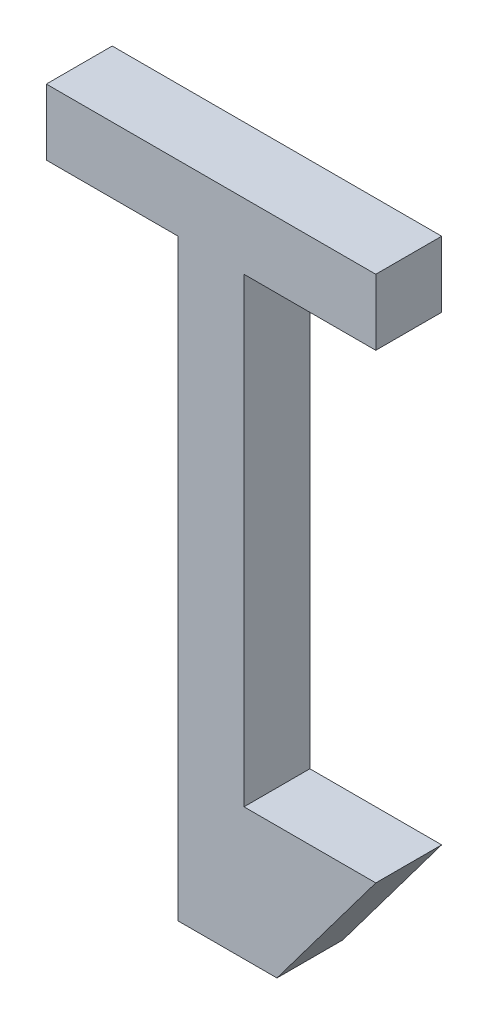
ISO-10303-21;
HEADER;
FILE_DESCRIPTION(('STEP AP214'),'2;1');
FILE_NAME('part.step','',(''),(''),'','','');
FILE_SCHEMA(('AUTOMOTIVE_DESIGN { 1 0 10303 214 1 1 1 1 }'));
ENDSEC;
DATA;
#1=APPLICATION_CONTEXT('core data for automotive mechanical design processes');
#2=APPLICATION_PROTOCOL_DEFINITION('international standard','automotive_design',2000,#1);
#3=PRODUCT_CONTEXT('',#1,'mechanical');
#4=PRODUCT('Part','Part','',(#3));
#5=PRODUCT_RELATED_PRODUCT_CATEGORY('part','',(#4));
#6=PRODUCT_DEFINITION_FORMATION('','',#4);
#7=PRODUCT_DEFINITION_CONTEXT('part definition',#1,'design');
#8=PRODUCT_DEFINITION('design','',#6,#7);
#9=PRODUCT_DEFINITION_SHAPE('','',#8);
#10=(LENGTH_UNIT() NAMED_UNIT(*) SI_UNIT(.MILLI.,.METRE.));
#11=(NAMED_UNIT(*) PLANE_ANGLE_UNIT() SI_UNIT($,.RADIAN.));
#12=(NAMED_UNIT(*) SI_UNIT($,.STERADIAN.) SOLID_ANGLE_UNIT());
#13=UNCERTAINTY_MEASURE_WITH_UNIT(LENGTH_MEASURE(1.E-05),#10,'distance_accuracy_value','');
#14=(GEOMETRIC_REPRESENTATION_CONTEXT(3) GLOBAL_UNCERTAINTY_ASSIGNED_CONTEXT((#13)) GLOBAL_UNIT_ASSIGNED_CONTEXT((#10,
#11,#12)) REPRESENTATION_CONTEXT('',''));
#15=CARTESIAN_POINT('',(0.,0.,0.));
#16=DIRECTION('',(0.,0.,1.));
#17=DIRECTION('',(1.,0.,0.));
#18=AXIS2_PLACEMENT_3D('',#15,#16,#17);
#19=CARTESIAN_POINT('',(0.0635,-0.0762,0.0254));
#20=DIRECTION('',(0.,0.,1.));
#21=DIRECTION('',(1.,0.,0.));
#22=AXIS2_PLACEMENT_3D('',#19,#20,#21);
#23=PLANE('',#22);
#24=DIRECTION('',(1.,0.,0.));
#25=VECTOR('',#24,1.);
#26=CARTESIAN_POINT('',(0.0254,-0.127,0.0254));
#27=LINE('',#26,#25);
#28=CARTESIAN_POINT('',(0.0254,-0.127,0.0254));
#29=VERTEX_POINT('',#28);
#30=CARTESIAN_POINT('',(-0.0127,-0.127,0.0254));
#31=VERTEX_POINT('',#30);
#32=EDGE_CURVE('E137',#29,#31,#27,.F.);
#33=ORIENTED_EDGE('',*,*,#32,.F.);
#34=DIRECTION('',(0.6,0.8,0.));
#35=VECTOR('',#34,1.);
#36=CARTESIAN_POINT('',(0.0635,-0.0762,0.0254));
#37=LINE('',#36,#35);
#38=CARTESIAN_POINT('',(0.0635,-0.0762,0.0254));
#39=VERTEX_POINT('',#38);
#40=EDGE_CURVE('E106',#39,#29,#37,.F.);
#41=ORIENTED_EDGE('',*,*,#40,.F.);
#42=DIRECTION('',(1.,0.,0.));
#43=VECTOR('',#42,1.);
#44=CARTESIAN_POINT('',(0.0127,-0.0762,0.0254));
#45=LINE('',#44,#43);
#46=CARTESIAN_POINT('',(0.0127,-0.0762,0.0254));
#47=VERTEX_POINT('',#46);
#48=EDGE_CURVE('E20',#47,#39,#45,.T.);
#49=ORIENTED_EDGE('',*,*,#48,.F.);
#50=DIRECTION('',(0.,1.,0.));
#51=VECTOR('',#50,1.);
#52=CARTESIAN_POINT('',(0.0127,0.1016,0.0254));
#53=LINE('',#52,#51);
#54=CARTESIAN_POINT('',(0.0127,0.1016,0.0254));
#55=VERTEX_POINT('',#54);
#56=EDGE_CURVE('E95',#55,#47,#53,.F.);
#57=ORIENTED_EDGE('',*,*,#56,.F.);
#58=DIRECTION('',(1.,0.,0.));
#59=VECTOR('',#58,1.);
#60=CARTESIAN_POINT('',(0.0635,0.1016,0.0254));
#61=LINE('',#60,#59);
#62=CARTESIAN_POINT('',(0.0635,0.1016,0.0254));
#63=VERTEX_POINT('',#62);
#64=EDGE_CURVE('E90',#63,#55,#61,.F.);
#65=ORIENTED_EDGE('',*,*,#64,.F.);
#66=DIRECTION('',(0.,1.,0.));
#67=VECTOR('',#66,1.);
#68=CARTESIAN_POINT('',(0.0635,0.127,0.0254));
#69=LINE('',#68,#67);
#70=CARTESIAN_POINT('',(0.0635,0.127,0.0254));
#71=VERTEX_POINT('',#70);
#72=EDGE_CURVE('E117',#71,#63,#69,.F.);
#73=ORIENTED_EDGE('',*,*,#72,.F.);
#74=DIRECTION('',(1.,0.,0.));
#75=VECTOR('',#74,1.);
#76=CARTESIAN_POINT('',(-0.0635,0.127,0.0254));
#77=LINE('',#76,#75);
#78=CARTESIAN_POINT('',(-0.0635,0.127,0.0254));
#79=VERTEX_POINT('',#78);
#80=EDGE_CURVE('E121',#79,#71,#77,.T.);
#81=ORIENTED_EDGE('',*,*,#80,.F.);
#82=DIRECTION('',(0.,1.,0.));
#83=VECTOR('',#82,1.);
#84=CARTESIAN_POINT('',(-0.0635,0.1016,0.0254));
#85=LINE('',#84,#83);
#86=CARTESIAN_POINT('',(-0.0635,0.1016,0.0254));
#87=VERTEX_POINT('',#86);
#88=EDGE_CURVE('E125',#87,#79,#85,.T.);
#89=ORIENTED_EDGE('',*,*,#88,.F.);
#90=DIRECTION('',(1.,0.,0.));
#91=VECTOR('',#90,1.);
#92=CARTESIAN_POINT('',(-0.0127,0.1016,0.0254));
#93=LINE('',#92,#91);
#94=CARTESIAN_POINT('',(-0.0127,0.1016,0.0254));
#95=VERTEX_POINT('',#94);
#96=EDGE_CURVE('E129',#95,#87,#93,.F.);
#97=ORIENTED_EDGE('',*,*,#96,.F.);
#98=DIRECTION('',(0.,1.,0.));
#99=VECTOR('',#98,1.);
#100=CARTESIAN_POINT('',(-0.0127,-0.127,0.0254));
#101=LINE('',#100,#99);
#102=EDGE_CURVE('E133',#31,#95,#101,.T.);
#103=ORIENTED_EDGE('',*,*,#102,.F.);
#104=EDGE_LOOP('',(#33,#41,#49,#57,#65,#73,#81,#89,#97,#103));
#105=FACE_BOUND('',#104,.T.);
#106=ADVANCED_FACE('F17',(#105),#23,.T.);
#107=CARTESIAN_POINT('',(0.0127,-0.0762,0.));
#108=DIRECTION('',(0.,1.,0.));
#109=DIRECTION('',(0.,0.,1.));
#110=AXIS2_PLACEMENT_3D('',#107,#108,#109);
#111=PLANE('',#110);
#112=DIRECTION('',(0.,0.,1.));
#113=VECTOR('',#112,1.);
#114=CARTESIAN_POINT('',(0.0635,-0.0762,0.));
#115=LINE('',#114,#113);
#116=CARTESIAN_POINT('',(0.0635,-0.0762,0.));
#117=VERTEX_POINT('',#116);
#118=EDGE_CURVE('E141',#117,#39,#115,.T.);
#119=ORIENTED_EDGE('',*,*,#118,.F.);
#120=DIRECTION('',(1.,0.,0.));
#121=VECTOR('',#120,1.);
#122=CARTESIAN_POINT('',(0.0635,-0.0762,0.));
#123=LINE('',#122,#121);
#124=CARTESIAN_POINT('',(0.0127,-0.0762,0.));
#125=VERTEX_POINT('',#124);
#126=EDGE_CURVE('E112',#117,#125,#123,.F.);
#127=ORIENTED_EDGE('',*,*,#126,.T.);
#128=DIRECTION('',(0.,0.,-1.));
#129=VECTOR('',#128,1.);
#130=CARTESIAN_POINT('',(0.0127,-0.0762,0.));
#131=LINE('',#130,#129);
#132=EDGE_CURVE('E100',#47,#125,#131,.T.);
#133=ORIENTED_EDGE('',*,*,#132,.F.);
#134=ORIENTED_EDGE('',*,*,#48,.T.);
#135=EDGE_LOOP('',(#119,#127,#133,#134));
#136=FACE_BOUND('',#135,.T.);
#137=ADVANCED_FACE('F111',(#136),#111,.T.);
#138=CARTESIAN_POINT('',(0.0127,0.1016,0.));
#139=DIRECTION('',(1.,0.,0.));
#140=DIRECTION('',(0.,0.,-1.));
#141=AXIS2_PLACEMENT_3D('',#138,#139,#140);
#142=PLANE('',#141);
#143=ORIENTED_EDGE('',*,*,#132,.T.);
#144=DIRECTION('',(0.,1.,0.));
#145=VECTOR('',#144,1.);
#146=CARTESIAN_POINT('',(0.0127,-0.0762,0.));
#147=LINE('',#146,#145);
#148=CARTESIAN_POINT('',(0.0127,0.1016,0.));
#149=VERTEX_POINT('',#148);
#150=EDGE_CURVE('E146',#125,#149,#147,.T.);
#151=ORIENTED_EDGE('',*,*,#150,.T.);
#152=DIRECTION('',(0.,0.,-1.));
#153=VECTOR('',#152,1.);
#154=CARTESIAN_POINT('',(0.0127,0.1016,0.));
#155=LINE('',#154,#153);
#156=EDGE_CURVE('E102',#55,#149,#155,.T.);
#157=ORIENTED_EDGE('',*,*,#156,.F.);
#158=ORIENTED_EDGE('',*,*,#56,.T.);
#159=EDGE_LOOP('',(#143,#151,#157,#158));
#160=FACE_BOUND('',#159,.T.);
#161=ADVANCED_FACE('F97',(#160),#142,.T.);
#162=CARTESIAN_POINT('',(0.0635,0.1016,0.));
#163=DIRECTION('',(0.,-1.,0.));
#164=DIRECTION('',(0.,0.,-1.));
#165=AXIS2_PLACEMENT_3D('',#162,#163,#164);
#166=PLANE('',#165);
#167=ORIENTED_EDGE('',*,*,#156,.T.);
#168=DIRECTION('',(1.,0.,0.));
#169=VECTOR('',#168,1.);
#170=CARTESIAN_POINT('',(0.0635,0.1016,0.));
#171=LINE('',#170,#169);
#172=CARTESIAN_POINT('',(0.0635,0.1016,0.));
#173=VERTEX_POINT('',#172);
#174=EDGE_CURVE('E148',#149,#173,#171,.T.);
#175=ORIENTED_EDGE('',*,*,#174,.T.);
#176=DIRECTION('',(0.,0.,-1.));
#177=VECTOR('',#176,1.);
#178=CARTESIAN_POINT('',(0.0635,0.1016,0.));
#179=LINE('',#178,#177);
#180=EDGE_CURVE('E119',#63,#173,#179,.T.);
#181=ORIENTED_EDGE('',*,*,#180,.F.);
#182=ORIENTED_EDGE('',*,*,#64,.T.);
#183=EDGE_LOOP('',(#167,#175,#181,#182));
#184=FACE_BOUND('',#183,.T.);
#185=ADVANCED_FACE('F198',(#184),#166,.T.);
#186=CARTESIAN_POINT('',(0.0635,0.127,0.));
#187=DIRECTION('',(1.,0.,0.));
#188=DIRECTION('',(0.,0.,-1.));
#189=AXIS2_PLACEMENT_3D('',#186,#187,#188);
#190=PLANE('',#189);
#191=ORIENTED_EDGE('',*,*,#180,.T.);
#192=DIRECTION('',(0.,1.,0.));
#193=VECTOR('',#192,1.);
#194=CARTESIAN_POINT('',(0.0635,-0.0762,0.));
#195=LINE('',#194,#193);
#196=CARTESIAN_POINT('',(0.0635,0.127,0.));
#197=VERTEX_POINT('',#196);
#198=EDGE_CURVE('E151',#173,#197,#195,.T.);
#199=ORIENTED_EDGE('',*,*,#198,.T.);
#200=DIRECTION('',(0.,0.,1.));
#201=VECTOR('',#200,1.);
#202=CARTESIAN_POINT('',(0.0635,0.127,0.));
#203=LINE('',#202,#201);
#204=EDGE_CURVE('E123',#71,#197,#203,.F.);
#205=ORIENTED_EDGE('',*,*,#204,.F.);
#206=ORIENTED_EDGE('',*,*,#72,.T.);
#207=EDGE_LOOP('',(#191,#199,#205,#206));
#208=FACE_BOUND('',#207,.T.);
#209=ADVANCED_FACE('F197',(#208),#190,.T.);
#210=CARTESIAN_POINT('',(-0.0635,0.127,0.));
#211=DIRECTION('',(0.,1.,0.));
#212=DIRECTION('',(0.,0.,1.));
#213=AXIS2_PLACEMENT_3D('',#210,#211,#212);
#214=PLANE('',#213);
#215=ORIENTED_EDGE('',*,*,#204,.T.);
#216=DIRECTION('',(1.,0.,0.));
#217=VECTOR('',#216,1.);
#218=CARTESIAN_POINT('',(0.0635,0.127,0.));
#219=LINE('',#218,#217);
#220=CARTESIAN_POINT('',(-0.0635,0.127,0.));
#221=VERTEX_POINT('',#220);
#222=EDGE_CURVE('E154',#197,#221,#219,.F.);
#223=ORIENTED_EDGE('',*,*,#222,.T.);
#224=DIRECTION('',(0.,0.,1.));
#225=VECTOR('',#224,1.);
#226=CARTESIAN_POINT('',(-0.0635,0.127,0.));
#227=LINE('',#226,#225);
#228=EDGE_CURVE('E127',#79,#221,#227,.F.);
#229=ORIENTED_EDGE('',*,*,#228,.F.);
#230=ORIENTED_EDGE('',*,*,#80,.T.);
#231=EDGE_LOOP('',(#215,#223,#229,#230));
#232=FACE_BOUND('',#231,.T.);
#233=ADVANCED_FACE('F191',(#232),#214,.T.);
#234=CARTESIAN_POINT('',(-0.0635,0.1016,0.));
#235=DIRECTION('',(-1.,0.,0.));
#236=DIRECTION('',(0.,0.,1.));
#237=AXIS2_PLACEMENT_3D('',#234,#235,#236);
#238=PLANE('',#237);
#239=ORIENTED_EDGE('',*,*,#228,.T.);
#240=DIRECTION('',(0.,1.,0.));
#241=VECTOR('',#240,1.);
#242=CARTESIAN_POINT('',(-0.0635,-0.0762,0.));
#243=LINE('',#242,#241);
#244=CARTESIAN_POINT('',(-0.0635,0.1016,0.));
#245=VERTEX_POINT('',#244);
#246=EDGE_CURVE('E157',#221,#245,#243,.F.);
#247=ORIENTED_EDGE('',*,*,#246,.T.);
#248=DIRECTION('',(0.,0.,-1.));
#249=VECTOR('',#248,1.);
#250=CARTESIAN_POINT('',(-0.0635,0.1016,0.));
#251=LINE('',#250,#249);
#252=EDGE_CURVE('E131',#87,#245,#251,.T.);
#253=ORIENTED_EDGE('',*,*,#252,.F.);
#254=ORIENTED_EDGE('',*,*,#88,.T.);
#255=EDGE_LOOP('',(#239,#247,#253,#254));
#256=FACE_BOUND('',#255,.T.);
#257=ADVANCED_FACE('F187',(#256),#238,.T.);
#258=CARTESIAN_POINT('',(-0.0127,0.1016,0.));
#259=DIRECTION('',(0.,-1.,0.));
#260=DIRECTION('',(0.,0.,-1.));
#261=AXIS2_PLACEMENT_3D('',#258,#259,#260);
#262=PLANE('',#261);
#263=ORIENTED_EDGE('',*,*,#252,.T.);
#264=DIRECTION('',(1.,0.,0.));
#265=VECTOR('',#264,1.);
#266=CARTESIAN_POINT('',(0.0635,0.1016,0.));
#267=LINE('',#266,#265);
#268=CARTESIAN_POINT('',(-0.0127,0.1016,0.));
#269=VERTEX_POINT('',#268);
#270=EDGE_CURVE('E160',#245,#269,#267,.T.);
#271=ORIENTED_EDGE('',*,*,#270,.T.);
#272=DIRECTION('',(0.,0.,1.));
#273=VECTOR('',#272,1.);
#274=CARTESIAN_POINT('',(-0.0127,0.1016,0.));
#275=LINE('',#274,#273);
#276=EDGE_CURVE('E135',#95,#269,#275,.F.);
#277=ORIENTED_EDGE('',*,*,#276,.F.);
#278=ORIENTED_EDGE('',*,*,#96,.T.);
#279=EDGE_LOOP('',(#263,#271,#277,#278));
#280=FACE_BOUND('',#279,.T.);
#281=ADVANCED_FACE('F181',(#280),#262,.T.);
#282=CARTESIAN_POINT('',(-0.0127,-0.127,0.));
#283=DIRECTION('',(-1.,0.,0.));
#284=DIRECTION('',(0.,0.,1.));
#285=AXIS2_PLACEMENT_3D('',#282,#283,#284);
#286=PLANE('',#285);
#287=ORIENTED_EDGE('',*,*,#276,.T.);
#288=DIRECTION('',(0.,1.,0.));
#289=VECTOR('',#288,1.);
#290=CARTESIAN_POINT('',(-0.0127,-0.0762,0.));
#291=LINE('',#290,#289);
#292=CARTESIAN_POINT('',(-0.0127,-0.127,0.));
#293=VERTEX_POINT('',#292);
#294=EDGE_CURVE('E163',#269,#293,#291,.F.);
#295=ORIENTED_EDGE('',*,*,#294,.T.);
#296=DIRECTION('',(0.,0.,-1.));
#297=VECTOR('',#296,1.);
#298=CARTESIAN_POINT('',(-0.0127,-0.127,0.));
#299=LINE('',#298,#297);
#300=EDGE_CURVE('E139',#31,#293,#299,.T.);
#301=ORIENTED_EDGE('',*,*,#300,.F.);
#302=ORIENTED_EDGE('',*,*,#102,.T.);
#303=EDGE_LOOP('',(#287,#295,#301,#302));
#304=FACE_BOUND('',#303,.T.);
#305=ADVANCED_FACE('F176',(#304),#286,.T.);
#306=CARTESIAN_POINT('',(0.0254,-0.127,0.));
#307=DIRECTION('',(0.,-1.,0.));
#308=DIRECTION('',(0.,0.,-1.));
#309=AXIS2_PLACEMENT_3D('',#306,#307,#308);
#310=PLANE('',#309);
#311=ORIENTED_EDGE('',*,*,#300,.T.);
#312=DIRECTION('',(1.,0.,0.));
#313=VECTOR('',#312,1.);
#314=CARTESIAN_POINT('',(0.0635,-0.127,0.));
#315=LINE('',#314,#313);
#316=CARTESIAN_POINT('',(0.0254,-0.127,0.));
#317=VERTEX_POINT('',#316);
#318=EDGE_CURVE('E26',#293,#317,#315,.T.);
#319=ORIENTED_EDGE('',*,*,#318,.T.);
#320=DIRECTION('',(0.,0.,1.));
#321=VECTOR('',#320,1.);
#322=CARTESIAN_POINT('',(0.0254,-0.127,0.));
#323=LINE('',#322,#321);
#324=EDGE_CURVE('E34',#29,#317,#323,.F.);
#325=ORIENTED_EDGE('',*,*,#324,.F.);
#326=ORIENTED_EDGE('',*,*,#32,.T.);
#327=EDGE_LOOP('',(#311,#319,#325,#326));
#328=FACE_BOUND('',#327,.T.);
#329=ADVANCED_FACE('F169',(#328),#310,.T.);
#330=CARTESIAN_POINT('',(0.0635,-0.0762,0.));
#331=DIRECTION('',(0.8,-0.6,0.));
#332=DIRECTION('',(0.6,0.8,0.));
#333=AXIS2_PLACEMENT_3D('',#330,#331,#332);
#334=PLANE('',#333);
#335=ORIENTED_EDGE('',*,*,#324,.T.);
#336=DIRECTION('',(0.6,0.8,0.));
#337=VECTOR('',#336,1.);
#338=CARTESIAN_POINT('',(0.0254,-0.127,0.));
#339=LINE('',#338,#337);
#340=EDGE_CURVE('E11',#317,#117,#339,.T.);
#341=ORIENTED_EDGE('',*,*,#340,.T.);
#342=ORIENTED_EDGE('',*,*,#118,.T.);
#343=ORIENTED_EDGE('',*,*,#40,.T.);
#344=EDGE_LOOP('',(#335,#341,#342,#343));
#345=FACE_BOUND('',#344,.T.);
#346=ADVANCED_FACE('F199',(#345),#334,.T.);
#347=CARTESIAN_POINT('',(0.0635,-0.0762,0.));
#348=DIRECTION('',(0.,0.,1.));
#349=DIRECTION('',(1.,0.,0.));
#350=AXIS2_PLACEMENT_3D('',#347,#348,#349);
#351=PLANE('',#350);
#352=ORIENTED_EDGE('',*,*,#318,.F.);
#353=ORIENTED_EDGE('',*,*,#294,.F.);
#354=ORIENTED_EDGE('',*,*,#270,.F.);
#355=ORIENTED_EDGE('',*,*,#246,.F.);
#356=ORIENTED_EDGE('',*,*,#222,.F.);
#357=ORIENTED_EDGE('',*,*,#198,.F.);
#358=ORIENTED_EDGE('',*,*,#174,.F.);
#359=ORIENTED_EDGE('',*,*,#150,.F.);
#360=ORIENTED_EDGE('',*,*,#126,.F.);
#361=ORIENTED_EDGE('',*,*,#340,.F.);
#362=EDGE_LOOP('',(#352,#353,#354,#355,#356,#357,#358,#359,#360,#361));
#363=FACE_BOUND('',#362,.T.);
#364=ADVANCED_FACE('F173',(#363),#351,.F.);
#365=CLOSED_SHELL('',(#106,#137,#161,#185,#209,#233,#257,#281,#305,#329,#346,#364));
#366=MANIFOLD_SOLID_BREP('B1',#365);
#367=ADVANCED_BREP_SHAPE_REPRESENTATION('',(#18,#366),#14);
#368=SHAPE_DEFINITION_REPRESENTATION(#9,#367);
ENDSEC;
END-ISO-10303-21;
